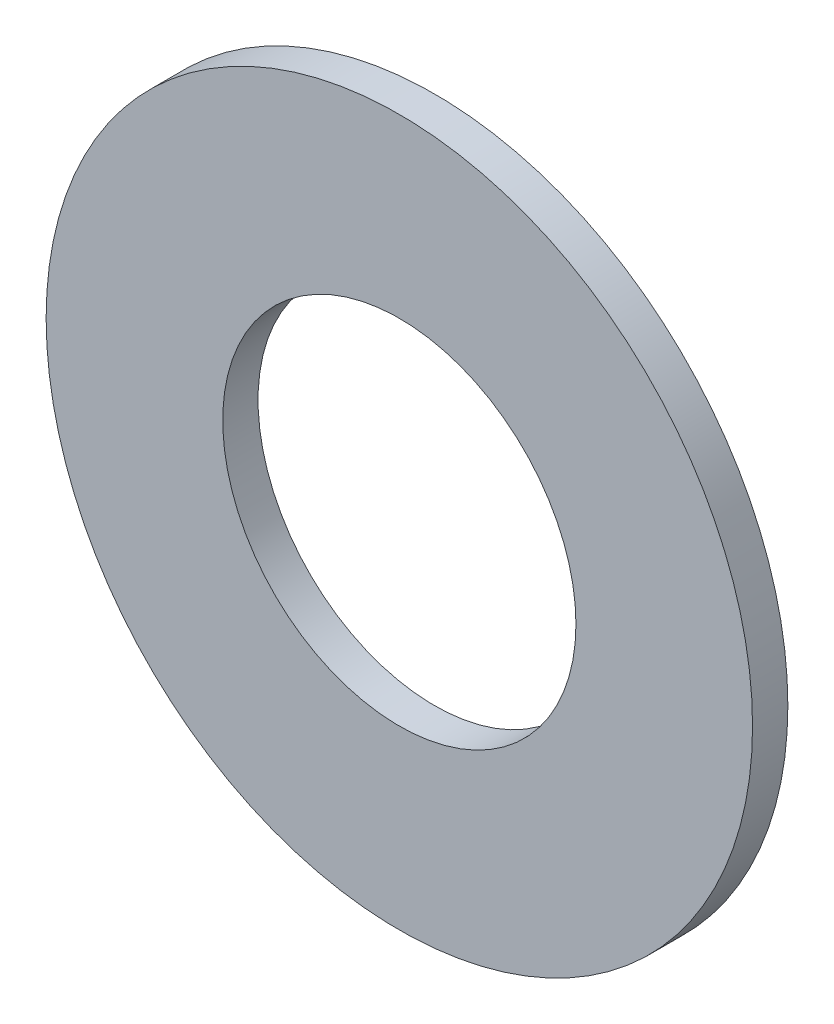
ISO-10303-21;
HEADER;
FILE_DESCRIPTION(('STEP AP214'),'2;1');
FILE_NAME('part.step','',(''),(''),'','','');
FILE_SCHEMA(('AUTOMOTIVE_DESIGN { 1 0 10303 214 1 1 1 1 }'));
ENDSEC;
DATA;
#1=APPLICATION_CONTEXT('core data for automotive mechanical design processes');
#2=APPLICATION_PROTOCOL_DEFINITION('international standard','automotive_design',2000,#1);
#3=PRODUCT_CONTEXT('',#1,'mechanical');
#4=PRODUCT('Part','Part','',(#3));
#5=PRODUCT_RELATED_PRODUCT_CATEGORY('part','',(#4));
#6=PRODUCT_DEFINITION_FORMATION('','',#4);
#7=PRODUCT_DEFINITION_CONTEXT('part definition',#1,'design');
#8=PRODUCT_DEFINITION('design','',#6,#7);
#9=PRODUCT_DEFINITION_SHAPE('','',#8);
#10=(LENGTH_UNIT() NAMED_UNIT(*) SI_UNIT(.MILLI.,.METRE.));
#11=(NAMED_UNIT(*) PLANE_ANGLE_UNIT() SI_UNIT($,.RADIAN.));
#12=(NAMED_UNIT(*) SI_UNIT($,.STERADIAN.) SOLID_ANGLE_UNIT());
#13=UNCERTAINTY_MEASURE_WITH_UNIT(LENGTH_MEASURE(1.E-05),#10,'distance_accuracy_value','');
#14=(GEOMETRIC_REPRESENTATION_CONTEXT(3) GLOBAL_UNCERTAINTY_ASSIGNED_CONTEXT((#13)) GLOBAL_UNIT_ASSIGNED_CONTEXT((#10,
#11,#12)) REPRESENTATION_CONTEXT('',''));
#15=CARTESIAN_POINT('',(0.,0.,0.));
#16=DIRECTION('',(0.,0.,1.));
#17=DIRECTION('',(1.,0.,0.));
#18=AXIS2_PLACEMENT_3D('',#15,#16,#17);
#19=CARTESIAN_POINT('',(0.,0.,1.));
#20=DIRECTION('',(0.,0.,1.));
#21=DIRECTION('',(1.,0.,0.));
#22=AXIS2_PLACEMENT_3D('',#19,#20,#21);
#23=PLANE('',#22);
#24=CARTESIAN_POINT('',(0.,0.,1.));
#25=DIRECTION('',(0.,0.,1.));
#26=DIRECTION('',(1.,0.,0.));
#27=AXIS2_PLACEMENT_3D('',#24,#25,#26);
#28=CIRCLE('',#27,10.);
#29=CARTESIAN_POINT('',(10.,0.,1.));
#30=VERTEX_POINT('',#29);
#31=EDGE_CURVE('E10',#30,#30,#28,.T.);
#32=ORIENTED_EDGE('',*,*,#31,.T.);
#33=EDGE_LOOP('',(#32));
#34=FACE_BOUND('',#33,.T.);
#35=CARTESIAN_POINT('',(0.,0.,1.));
#36=DIRECTION('',(0.,0.,1.));
#37=DIRECTION('',(1.,0.,0.));
#38=AXIS2_PLACEMENT_3D('',#35,#36,#37);
#39=CIRCLE('',#38,5.);
#40=CARTESIAN_POINT('',(5.,0.,1.));
#41=VERTEX_POINT('',#40);
#42=EDGE_CURVE('E40',#41,#41,#39,.T.);
#43=ORIENTED_EDGE('',*,*,#42,.F.);
#44=EDGE_LOOP('',(#43));
#45=FACE_BOUND('',#44,.T.);
#46=ADVANCED_FACE('F29',(#34,#45),#23,.T.);
#47=CARTESIAN_POINT('',(0.,0.,0.));
#48=DIRECTION('',(0.,0.,1.));
#49=DIRECTION('',(1.,0.,0.));
#50=AXIS2_PLACEMENT_3D('',#47,#48,#49);
#51=PLANE('',#50);
#52=CARTESIAN_POINT('',(0.,0.,0.));
#53=DIRECTION('',(0.,0.,1.));
#54=DIRECTION('',(1.,0.,0.));
#55=AXIS2_PLACEMENT_3D('',#52,#53,#54);
#56=CIRCLE('',#55,10.);
#57=CARTESIAN_POINT('',(10.,0.,0.));
#58=VERTEX_POINT('',#57);
#59=EDGE_CURVE('E33',#58,#58,#56,.T.);
#60=ORIENTED_EDGE('',*,*,#59,.F.);
#61=EDGE_LOOP('',(#60));
#62=FACE_BOUND('',#61,.T.);
#63=CARTESIAN_POINT('',(0.,0.,0.));
#64=DIRECTION('',(0.,0.,1.));
#65=DIRECTION('',(1.,0.,0.));
#66=AXIS2_PLACEMENT_3D('',#63,#64,#65);
#67=CIRCLE('',#66,5.);
#68=CARTESIAN_POINT('',(5.,0.,0.));
#69=VERTEX_POINT('',#68);
#70=EDGE_CURVE('E42',#69,#69,#67,.T.);
#71=ORIENTED_EDGE('',*,*,#70,.T.);
#72=EDGE_LOOP('',(#71));
#73=FACE_BOUND('',#72,.T.);
#74=ADVANCED_FACE('F52',(#62,#73),#51,.F.);
#75=CARTESIAN_POINT('',(0.,0.,1.));
#76=DIRECTION('',(0.,0.,-1.));
#77=DIRECTION('',(-1.,0.,0.));
#78=AXIS2_PLACEMENT_3D('',#75,#76,#77);
#79=CYLINDRICAL_SURFACE('',#78,10.);
#80=ORIENTED_EDGE('',*,*,#31,.F.);
#81=EDGE_LOOP('',(#80));
#82=FACE_BOUND('',#81,.T.);
#83=ORIENTED_EDGE('',*,*,#59,.T.);
#84=EDGE_LOOP('',(#83));
#85=FACE_BOUND('',#84,.T.);
#86=ADVANCED_FACE('F31',(#82,#85),#79,.T.);
#87=CARTESIAN_POINT('',(0.,0.,1.));
#88=DIRECTION('',(0.,0.,-1.));
#89=DIRECTION('',(-1.,0.,0.));
#90=AXIS2_PLACEMENT_3D('',#87,#88,#89);
#91=CYLINDRICAL_SURFACE('',#90,5.);
#92=ORIENTED_EDGE('',*,*,#42,.T.);
#93=EDGE_LOOP('',(#92));
#94=FACE_BOUND('',#93,.T.);
#95=ORIENTED_EDGE('',*,*,#70,.F.);
#96=EDGE_LOOP('',(#95));
#97=FACE_BOUND('',#96,.T.);
#98=ADVANCED_FACE('F48',(#94,#97),#91,.F.);
#99=CLOSED_SHELL('',(#46,#74,#86,#98));
#100=MANIFOLD_SOLID_BREP('B2',#99);
#101=ADVANCED_BREP_SHAPE_REPRESENTATION('',(#18,#100),#14);
#102=SHAPE_DEFINITION_REPRESENTATION(#9,#101);
ENDSEC;
END-ISO-10303-21;
